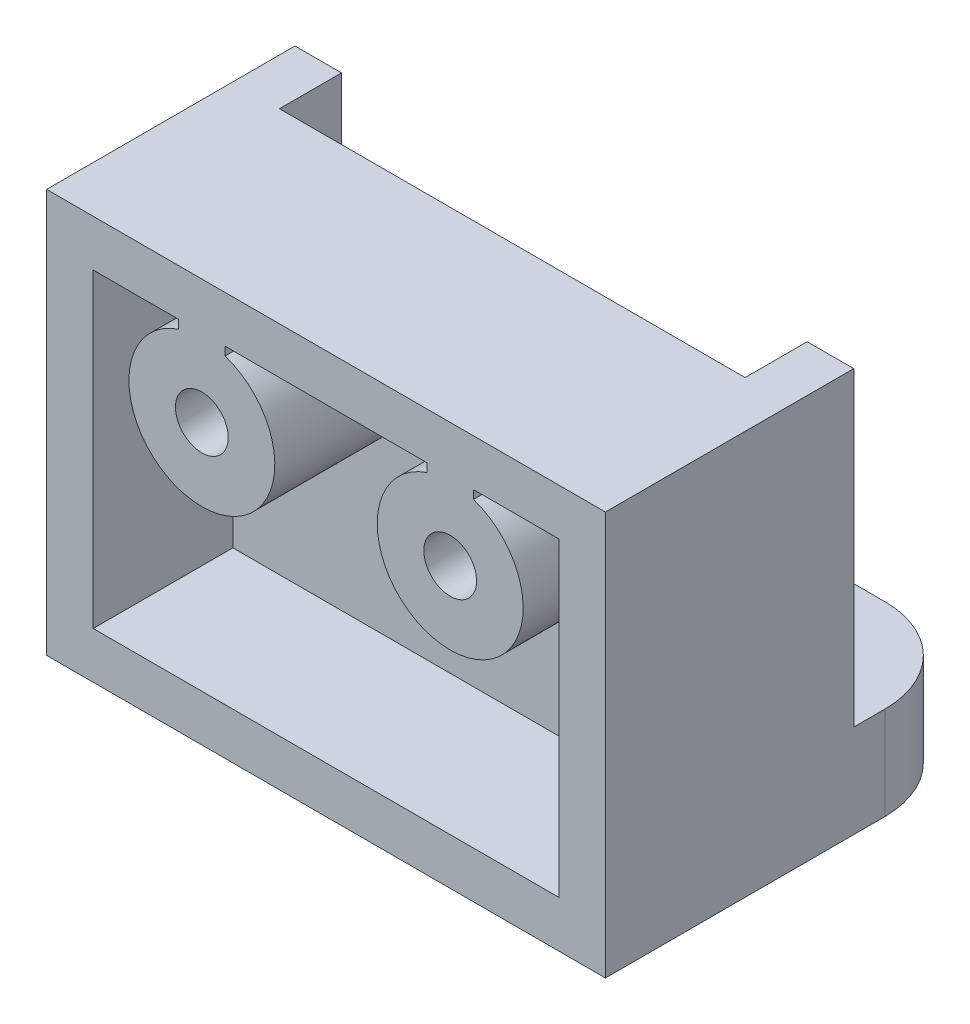
ISO-10303-21;
HEADER;
FILE_DESCRIPTION(('STEP AP214'),'2;1');
FILE_NAME('part.step','',(''),(''),'','','');
FILE_SCHEMA(('AUTOMOTIVE_DESIGN { 1 0 10303 214 1 1 1 1 }'));
ENDSEC;
DATA;
#1=APPLICATION_CONTEXT('core data for automotive mechanical design processes');
#2=APPLICATION_PROTOCOL_DEFINITION('international standard','automotive_design',2000,#1);
#3=PRODUCT_CONTEXT('',#1,'mechanical');
#4=PRODUCT('Part','Part','',(#3));
#5=PRODUCT_RELATED_PRODUCT_CATEGORY('part','',(#4));
#6=PRODUCT_DEFINITION_FORMATION('','',#4);
#7=PRODUCT_DEFINITION_CONTEXT('part definition',#1,'design');
#8=PRODUCT_DEFINITION('design','',#6,#7);
#9=PRODUCT_DEFINITION_SHAPE('','',#8);
#10=(LENGTH_UNIT() NAMED_UNIT(*) SI_UNIT(.MILLI.,.METRE.));
#11=(NAMED_UNIT(*) PLANE_ANGLE_UNIT() SI_UNIT($,.RADIAN.));
#12=(NAMED_UNIT(*) SI_UNIT($,.STERADIAN.) SOLID_ANGLE_UNIT());
#13=UNCERTAINTY_MEASURE_WITH_UNIT(LENGTH_MEASURE(1.E-05),#10,'distance_accuracy_value','');
#14=(GEOMETRIC_REPRESENTATION_CONTEXT(3) GLOBAL_UNCERTAINTY_ASSIGNED_CONTEXT((#13)) GLOBAL_UNIT_ASSIGNED_CONTEXT((#10,
#11,#12)) REPRESENTATION_CONTEXT('',''));
#15=CARTESIAN_POINT('',(0.,0.,0.));
#16=DIRECTION('',(0.,0.,1.));
#17=DIRECTION('',(1.,0.,0.));
#18=AXIS2_PLACEMENT_3D('',#15,#16,#17);
#19=CARTESIAN_POINT('',(0.,8.5,0.));
#20=DIRECTION('',(0.,1.,0.));
#21=DIRECTION('',(0.,0.,1.));
#22=AXIS2_PLACEMENT_3D('',#19,#20,#21);
#23=PLANE('',#22);
#24=DIRECTION('',(0.,0.,1.));
#25=VECTOR('',#24,1.);
#26=CARTESIAN_POINT('',(-3.25,8.5,0.));
#27=LINE('',#26,#25);
#28=CARTESIAN_POINT('',(-3.25,8.5,-20.5));
#29=VERTEX_POINT('',#28);
#30=CARTESIAN_POINT('',(-3.25,8.5,-16.));
#31=VERTEX_POINT('',#30);
#32=EDGE_CURVE('E198',#29,#31,#27,.T.);
#33=ORIENTED_EDGE('',*,*,#32,.F.);
#34=DIRECTION('',(-1.,0.,0.));
#35=VECTOR('',#34,1.);
#36=CARTESIAN_POINT('',(-7.49999999999999,8.5,-20.5));
#37=LINE('',#36,#35);
#38=CARTESIAN_POINT('',(3.25,8.5,-20.5));
#39=VERTEX_POINT('',#38);
#40=EDGE_CURVE('E403',#39,#29,#37,.T.);
#41=ORIENTED_EDGE('',*,*,#40,.F.);
#42=DIRECTION('',(0.,0.,1.));
#43=VECTOR('',#42,1.);
#44=CARTESIAN_POINT('',(3.25,8.5,0.));
#45=LINE('',#44,#43);
#46=CARTESIAN_POINT('',(3.25,8.5,-16.));
#47=VERTEX_POINT('',#46);
#48=EDGE_CURVE('E218',#39,#47,#45,.T.);
#49=ORIENTED_EDGE('',*,*,#48,.T.);
#50=DIRECTION('',(1.,0.,0.));
#51=VECTOR('',#50,1.);
#52=CARTESIAN_POINT('',(9.00000000000001,8.5,-16.));
#53=LINE('',#52,#51);
#54=EDGE_CURVE('E213',#31,#47,#53,.T.);
#55=ORIENTED_EDGE('',*,*,#54,.F.);
#56=EDGE_LOOP('',(#33,#41,#49,#55));
#57=FACE_BOUND('',#56,.T.);
#58=ADVANCED_FACE('F37',(#57),#23,.F.);
#59=DIRECTION('',(0.,0.,1.));
#60=VECTOR('',#59,1.);
#61=CARTESIAN_POINT('',(4.75,8.5,0.));
#62=LINE('',#61,#60);
#63=CARTESIAN_POINT('',(4.75,8.5,-20.5));
#64=VERTEX_POINT('',#63);
#65=CARTESIAN_POINT('',(4.75,8.5,-16.));
#66=VERTEX_POINT('',#65);
#67=EDGE_CURVE('E378',#64,#66,#62,.T.);
#68=ORIENTED_EDGE('',*,*,#67,.F.);
#69=CARTESIAN_POINT('',(7.5,8.5,-20.5));
#70=VERTEX_POINT('',#69);
#71=EDGE_CURVE('E377',#70,#64,#37,.T.);
#72=ORIENTED_EDGE('',*,*,#71,.F.);
#73=DIRECTION('',(0.,0.,-1.));
#74=VECTOR('',#73,1.);
#75=CARTESIAN_POINT('',(7.50000000000001,8.5,0.));
#76=LINE('',#75,#74);
#77=CARTESIAN_POINT('',(7.5,8.5,-16.));
#78=VERTEX_POINT('',#77);
#79=EDGE_CURVE('E390',#78,#70,#76,.T.);
#80=ORIENTED_EDGE('',*,*,#79,.F.);
#81=EDGE_CURVE('E220',#66,#78,#53,.T.);
#82=ORIENTED_EDGE('',*,*,#81,.F.);
#83=EDGE_LOOP('',(#68,#72,#80,#82));
#84=FACE_BOUND('',#83,.T.);
#85=ADVANCED_FACE('F432',(#84),#23,.F.);
#86=CARTESIAN_POINT('',(0.,0.,0.));
#87=DIRECTION('',(0.,-1.,0.));
#88=DIRECTION('',(0.,0.,-1.));
#89=AXIS2_PLACEMENT_3D('',#86,#87,#88);
#90=PLANE('',#89);
#91=CARTESIAN_POINT('',(-4.,0.,-25.));
#92=DIRECTION('',(0.,-1.,0.));
#93=DIRECTION('',(0.,0.,-1.));
#94=AXIS2_PLACEMENT_3D('',#91,#92,#93);
#95=CIRCLE('',#94,1.6);
#96=CARTESIAN_POINT('',(-4.,0.,-26.6));
#97=VERTEX_POINT('',#96);
#98=EDGE_CURVE('E308',#97,#97,#95,.T.);
#99=ORIENTED_EDGE('',*,*,#98,.T.);
#100=EDGE_LOOP('',(#99));
#101=FACE_BOUND('',#100,.T.);
#102=CARTESIAN_POINT('',(4.,0.,-25.));
#103=DIRECTION('',(0.,-1.,0.));
#104=DIRECTION('',(0.,0.,-1.));
#105=AXIS2_PLACEMENT_3D('',#102,#103,#104);
#106=CIRCLE('',#105,1.6);
#107=CARTESIAN_POINT('',(4.,0.,-26.6));
#108=VERTEX_POINT('',#107);
#109=EDGE_CURVE('E312',#108,#108,#106,.T.);
#110=ORIENTED_EDGE('',*,*,#109,.T.);
#111=EDGE_LOOP('',(#110));
#112=FACE_BOUND('',#111,.T.);
#113=CARTESIAN_POINT('',(6.,0.,-25.));
#114=DIRECTION('',(0.,-1.,0.));
#115=DIRECTION('',(0.,0.,-1.));
#116=AXIS2_PLACEMENT_3D('',#113,#114,#115);
#117=CIRCLE('',#116,3.);
#118=CARTESIAN_POINT('',(9.00000000000001,0.,-25.));
#119=VERTEX_POINT('',#118);
#120=CARTESIAN_POINT('',(6.,0.,-28.));
#121=VERTEX_POINT('',#120);
#122=EDGE_CURVE('E340',#119,#121,#117,.F.);
#123=ORIENTED_EDGE('',*,*,#122,.T.);
#124=DIRECTION('',(1.,0.,0.));
#125=VECTOR('',#124,1.);
#126=CARTESIAN_POINT('',(-8.99999999999999,0.,-28.));
#127=LINE('',#126,#125);
#128=CARTESIAN_POINT('',(-6.,0.,-28.));
#129=VERTEX_POINT('',#128);
#130=EDGE_CURVE('E325',#129,#121,#127,.T.);
#131=ORIENTED_EDGE('',*,*,#130,.F.);
#132=CARTESIAN_POINT('',(-6.,0.,-25.));
#133=DIRECTION('',(0.,-1.,0.));
#134=DIRECTION('',(0.,0.,-1.));
#135=AXIS2_PLACEMENT_3D('',#132,#133,#134);
#136=CIRCLE('',#135,3.);
#137=CARTESIAN_POINT('',(-8.99999999999999,0.,-25.));
#138=VERTEX_POINT('',#137);
#139=EDGE_CURVE('E337',#129,#138,#136,.F.);
#140=ORIENTED_EDGE('',*,*,#139,.T.);
#141=DIRECTION('',(0.,0.,-1.));
#142=VECTOR('',#141,1.);
#143=CARTESIAN_POINT('',(-8.99999999999999,0.,0.));
#144=LINE('',#143,#142);
#145=CARTESIAN_POINT('',(-8.99999999999999,0.,-24.));
#146=VERTEX_POINT('',#145);
#147=EDGE_CURVE('E332',#146,#138,#144,.T.);
#148=ORIENTED_EDGE('',*,*,#147,.F.);
#149=DIRECTION('',(-1.,0.,0.));
#150=VECTOR('',#149,1.);
#151=CARTESIAN_POINT('',(-8.99999999999999,0.,-24.));
#152=LINE('',#151,#150);
#153=CARTESIAN_POINT('',(-7.49999999999999,0.,-24.));
#154=VERTEX_POINT('',#153);
#155=EDGE_CURVE('E259',#154,#146,#152,.T.);
#156=ORIENTED_EDGE('',*,*,#155,.F.);
#157=DIRECTION('',(0.,0.,-1.));
#158=VECTOR('',#157,1.);
#159=CARTESIAN_POINT('',(-7.49999999999999,0.,-24.));
#160=LINE('',#159,#158);
#161=CARTESIAN_POINT('',(-7.49999999999999,0.,-22.));
#162=VERTEX_POINT('',#161);
#163=EDGE_CURVE('E281',#162,#154,#160,.T.);
#164=ORIENTED_EDGE('',*,*,#163,.F.);
#165=DIRECTION('',(-1.,0.,0.));
#166=VECTOR('',#165,1.);
#167=CARTESIAN_POINT('',(-7.49999999999999,0.,-22.));
#168=LINE('',#167,#166);
#169=CARTESIAN_POINT('',(7.50000000000001,0.,-22.));
#170=VERTEX_POINT('',#169);
#171=EDGE_CURVE('E279',#170,#162,#168,.T.);
#172=ORIENTED_EDGE('',*,*,#171,.F.);
#173=DIRECTION('',(0.,0.,1.));
#174=VECTOR('',#173,1.);
#175=CARTESIAN_POINT('',(7.50000000000001,0.,-24.));
#176=LINE('',#175,#174);
#177=CARTESIAN_POINT('',(7.50000000000001,0.,-24.));
#178=VERTEX_POINT('',#177);
#179=EDGE_CURVE('E276',#178,#170,#176,.T.);
#180=ORIENTED_EDGE('',*,*,#179,.F.);
#181=DIRECTION('',(-1.,0.,0.));
#182=VECTOR('',#181,1.);
#183=CARTESIAN_POINT('',(9.00000000000001,0.,-24.));
#184=LINE('',#183,#182);
#185=CARTESIAN_POINT('',(9.00000000000001,0.,-24.));
#186=VERTEX_POINT('',#185);
#187=EDGE_CURVE('E254',#186,#178,#184,.T.);
#188=ORIENTED_EDGE('',*,*,#187,.F.);
#189=DIRECTION('',(0.,0.,1.));
#190=VECTOR('',#189,1.);
#191=CARTESIAN_POINT('',(9.00000000000001,0.,-28.));
#192=LINE('',#191,#190);
#193=EDGE_CURVE('E318',#119,#186,#192,.T.);
#194=ORIENTED_EDGE('',*,*,#193,.F.);
#195=EDGE_LOOP('',(#123,#131,#140,#148,#156,#164,#172,#180,#188,#194));
#196=FACE_BOUND('',#195,.T.);
#197=ADVANCED_FACE('F454',(#101,#112,#196),#90,.F.);
#198=CARTESIAN_POINT('',(-8.99999999999999,30.,-10.1));
#199=DIRECTION('',(1.,0.,0.));
#200=DIRECTION('',(0.,0.,-1.));
#201=AXIS2_PLACEMENT_3D('',#198,#199,#200);
#202=PLANE('',#201);
#203=DIRECTION('',(0.,0.,-1.));
#204=VECTOR('',#203,1.);
#205=CARTESIAN_POINT('',(-8.99999999999999,-3.,0.));
#206=LINE('',#205,#204);
#207=CARTESIAN_POINT('',(-8.99999999999999,-3.,-16.));
#208=VERTEX_POINT('',#207);
#209=CARTESIAN_POINT('',(-8.99999999999999,-3.,-25.));
#210=VERTEX_POINT('',#209);
#211=EDGE_CURVE('E324',#208,#210,#206,.T.);
#212=ORIENTED_EDGE('',*,*,#211,.F.);
#213=DIRECTION('',(0.,-1.,0.));
#214=VECTOR('',#213,1.);
#215=CARTESIAN_POINT('',(-8.99999999999999,10.,-16.));
#216=LINE('',#215,#214);
#217=CARTESIAN_POINT('',(-8.99999999999999,10.,-16.));
#218=VERTEX_POINT('',#217);
#219=EDGE_CURVE('E287',#218,#208,#216,.T.);
#220=ORIENTED_EDGE('',*,*,#219,.F.);
#221=DIRECTION('',(0.,0.,1.));
#222=VECTOR('',#221,1.);
#223=CARTESIAN_POINT('',(-8.99999999999999,10.,-16.));
#224=LINE('',#223,#222);
#225=CARTESIAN_POINT('',(-8.99999999999999,10.,-24.));
#226=VERTEX_POINT('',#225);
#227=EDGE_CURVE('E269',#226,#218,#224,.T.);
#228=ORIENTED_EDGE('',*,*,#227,.F.);
#229=DIRECTION('',(0.,-1.,0.));
#230=VECTOR('',#229,1.);
#231=CARTESIAN_POINT('',(-8.99999999999999,10.,-24.));
#232=LINE('',#231,#230);
#233=EDGE_CURVE('E290',#226,#146,#232,.T.);
#234=ORIENTED_EDGE('',*,*,#233,.T.);
#235=ORIENTED_EDGE('',*,*,#147,.T.);
#236=DIRECTION('',(0.,1.,0.));
#237=VECTOR('',#236,1.);
#238=CARTESIAN_POINT('',(-9.,30.,-25.));
#239=LINE('',#238,#237);
#240=EDGE_CURVE('E353',#138,#210,#239,.F.);
#241=ORIENTED_EDGE('',*,*,#240,.T.);
#242=EDGE_LOOP('',(#212,#220,#228,#234,#235,#241));
#243=FACE_BOUND('',#242,.T.);
#244=ADVANCED_FACE('F530',(#243),#202,.F.);
#245=CARTESIAN_POINT('',(9.00000000000001,30.,0.));
#246=DIRECTION('',(-1.,0.,0.));
#247=DIRECTION('',(0.,0.,1.));
#248=AXIS2_PLACEMENT_3D('',#245,#246,#247);
#249=PLANE('',#248);
#250=DIRECTION('',(0.,-1.,0.));
#251=VECTOR('',#250,1.);
#252=CARTESIAN_POINT('',(9.00000000000001,10.,-16.));
#253=LINE('',#252,#251);
#254=CARTESIAN_POINT('',(9.00000000000001,10.,-16.));
#255=VERTEX_POINT('',#254);
#256=CARTESIAN_POINT('',(9.00000000000001,-3.,-16.));
#257=VERTEX_POINT('',#256);
#258=EDGE_CURVE('E273',#255,#257,#253,.T.);
#259=ORIENTED_EDGE('',*,*,#258,.T.);
#260=DIRECTION('',(0.,0.,1.));
#261=VECTOR('',#260,1.);
#262=CARTESIAN_POINT('',(9.00000000000001,-3.,-28.));
#263=LINE('',#262,#261);
#264=CARTESIAN_POINT('',(9.00000000000001,-3.,-25.));
#265=VERTEX_POINT('',#264);
#266=EDGE_CURVE('E321',#265,#257,#263,.T.);
#267=ORIENTED_EDGE('',*,*,#266,.F.);
#268=DIRECTION('',(0.,1.,0.));
#269=VECTOR('',#268,1.);
#270=CARTESIAN_POINT('',(9.,30.,-25.));
#271=LINE('',#270,#269);
#272=EDGE_CURVE('E329',#265,#119,#271,.T.);
#273=ORIENTED_EDGE('',*,*,#272,.T.);
#274=ORIENTED_EDGE('',*,*,#193,.T.);
#275=DIRECTION('',(0.,-1.,0.));
#276=VECTOR('',#275,1.);
#277=CARTESIAN_POINT('',(9.00000000000001,10.,-24.));
#278=LINE('',#277,#276);
#279=CARTESIAN_POINT('',(9.00000000000001,10.,-24.));
#280=VERTEX_POINT('',#279);
#281=EDGE_CURVE('E305',#280,#186,#278,.T.);
#282=ORIENTED_EDGE('',*,*,#281,.F.);
#283=DIRECTION('',(0.,0.,-1.));
#284=VECTOR('',#283,1.);
#285=CARTESIAN_POINT('',(9.00000000000001,10.,-16.));
#286=LINE('',#285,#284);
#287=EDGE_CURVE('E255',#255,#280,#286,.T.);
#288=ORIENTED_EDGE('',*,*,#287,.F.);
#289=EDGE_LOOP('',(#259,#267,#273,#274,#282,#288));
#290=FACE_BOUND('',#289,.T.);
#291=ADVANCED_FACE('F526',(#290),#249,.F.);
#292=CARTESIAN_POINT('',(0.,-3.,0.));
#293=DIRECTION('',(0.,-1.,0.));
#294=DIRECTION('',(0.,0.,-1.));
#295=AXIS2_PLACEMENT_3D('',#292,#293,#294);
#296=PLANE('',#295);
#297=CARTESIAN_POINT('',(-4.,-3.,-25.));
#298=DIRECTION('',(0.,-1.,0.));
#299=DIRECTION('',(0.,0.,-1.));
#300=AXIS2_PLACEMENT_3D('',#297,#298,#299);
#301=CIRCLE('',#300,1.6);
#302=CARTESIAN_POINT('',(-4.,-3.,-26.6));
#303=VERTEX_POINT('',#302);
#304=EDGE_CURVE('E309',#303,#303,#301,.T.);
#305=ORIENTED_EDGE('',*,*,#304,.F.);
#306=EDGE_LOOP('',(#305));
#307=FACE_BOUND('',#306,.T.);
#308=DIRECTION('',(1.,0.,0.));
#309=VECTOR('',#308,1.);
#310=CARTESIAN_POINT('',(-8.99999999999999,-3.,-28.));
#311=LINE('',#310,#309);
#312=CARTESIAN_POINT('',(-6.,-3.,-28.));
#313=VERTEX_POINT('',#312);
#314=CARTESIAN_POINT('',(6.,-3.,-28.));
#315=VERTEX_POINT('',#314);
#316=EDGE_CURVE('E327',#313,#315,#311,.T.);
#317=ORIENTED_EDGE('',*,*,#316,.T.);
#318=CARTESIAN_POINT('',(6.,-3.,-25.));
#319=DIRECTION('',(0.,-1.,0.));
#320=DIRECTION('',(0.,0.,-1.));
#321=AXIS2_PLACEMENT_3D('',#318,#319,#320);
#322=CIRCLE('',#321,3.);
#323=EDGE_CURVE('E351',#315,#265,#322,.T.);
#324=ORIENTED_EDGE('',*,*,#323,.T.);
#325=ORIENTED_EDGE('',*,*,#266,.T.);
#326=DIRECTION('',(-1.,0.,0.));
#327=VECTOR('',#326,1.);
#328=CARTESIAN_POINT('',(9.00000000000001,-3.,-16.));
#329=LINE('',#328,#327);
#330=EDGE_CURVE('E252',#257,#208,#329,.T.);
#331=ORIENTED_EDGE('',*,*,#330,.T.);
#332=ORIENTED_EDGE('',*,*,#211,.T.);
#333=CARTESIAN_POINT('',(-6.,-3.,-25.));
#334=DIRECTION('',(0.,-1.,0.));
#335=DIRECTION('',(0.,0.,-1.));
#336=AXIS2_PLACEMENT_3D('',#333,#334,#335);
#337=CIRCLE('',#336,3.);
#338=EDGE_CURVE('E349',#210,#313,#337,.T.);
#339=ORIENTED_EDGE('',*,*,#338,.T.);
#340=EDGE_LOOP('',(#317,#324,#325,#331,#332,#339));
#341=FACE_BOUND('',#340,.T.);
#342=CARTESIAN_POINT('',(4.,-3.,-25.));
#343=DIRECTION('',(0.,-1.,0.));
#344=DIRECTION('',(0.,0.,-1.));
#345=AXIS2_PLACEMENT_3D('',#342,#343,#344);
#346=CIRCLE('',#345,1.6);
#347=CARTESIAN_POINT('',(4.,-3.,-26.6));
#348=VERTEX_POINT('',#347);
#349=EDGE_CURVE('E315',#348,#348,#346,.T.);
#350=ORIENTED_EDGE('',*,*,#349,.F.);
#351=EDGE_LOOP('',(#350));
#352=FACE_BOUND('',#351,.T.);
#353=ADVANCED_FACE('F523',(#307,#341,#352),#296,.T.);
#354=CARTESIAN_POINT('',(-8.99999999999999,-3.,-28.));
#355=DIRECTION('',(0.,0.,1.));
#356=DIRECTION('',(1.,0.,0.));
#357=AXIS2_PLACEMENT_3D('',#354,#355,#356);
#358=PLANE('',#357);
#359=DIRECTION('',(0.,1.,0.));
#360=VECTOR('',#359,1.);
#361=CARTESIAN_POINT('',(6.,-3.,-28.));
#362=LINE('',#361,#360);
#363=EDGE_CURVE('E346',#121,#315,#362,.F.);
#364=ORIENTED_EDGE('',*,*,#363,.T.);
#365=ORIENTED_EDGE('',*,*,#316,.F.);
#366=DIRECTION('',(0.,1.,0.));
#367=VECTOR('',#366,1.);
#368=CARTESIAN_POINT('',(-6.,-3.,-28.));
#369=LINE('',#368,#367);
#370=EDGE_CURVE('E343',#313,#129,#369,.T.);
#371=ORIENTED_EDGE('',*,*,#370,.T.);
#372=ORIENTED_EDGE('',*,*,#130,.T.);
#373=EDGE_LOOP('',(#364,#365,#371,#372));
#374=FACE_BOUND('',#373,.T.);
#375=ADVANCED_FACE('F521',(#374),#358,.F.);
#376=CARTESIAN_POINT('',(4.,-3.,-25.));
#377=DIRECTION('',(0.,1.,0.));
#378=DIRECTION('',(0.,0.,1.));
#379=AXIS2_PLACEMENT_3D('',#376,#377,#378);
#380=CYLINDRICAL_SURFACE('',#379,1.6);
#381=ORIENTED_EDGE('',*,*,#109,.F.);
#382=EDGE_LOOP('',(#381));
#383=FACE_BOUND('',#382,.T.);
#384=ORIENTED_EDGE('',*,*,#349,.T.);
#385=EDGE_LOOP('',(#384));
#386=FACE_BOUND('',#385,.T.);
#387=ADVANCED_FACE('F517',(#383,#386),#380,.F.);
#388=CARTESIAN_POINT('',(-4.,-3.,-25.));
#389=DIRECTION('',(0.,1.,0.));
#390=DIRECTION('',(0.,0.,1.));
#391=AXIS2_PLACEMENT_3D('',#388,#389,#390);
#392=CYLINDRICAL_SURFACE('',#391,1.6);
#393=ORIENTED_EDGE('',*,*,#98,.F.);
#394=EDGE_LOOP('',(#393));
#395=FACE_BOUND('',#394,.T.);
#396=ORIENTED_EDGE('',*,*,#304,.T.);
#397=EDGE_LOOP('',(#396));
#398=FACE_BOUND('',#397,.T.);
#399=ADVANCED_FACE('F513',(#395,#398),#392,.F.);
#400=CARTESIAN_POINT('',(6.,30.,-25.));
#401=DIRECTION('',(0.,1.,0.));
#402=DIRECTION('',(0.,0.,1.));
#403=AXIS2_PLACEMENT_3D('',#400,#401,#402);
#404=CYLINDRICAL_SURFACE('',#403,3.);
#405=ORIENTED_EDGE('',*,*,#323,.F.);
#406=ORIENTED_EDGE('',*,*,#363,.F.);
#407=ORIENTED_EDGE('',*,*,#122,.F.);
#408=ORIENTED_EDGE('',*,*,#272,.F.);
#409=EDGE_LOOP('',(#405,#406,#407,#408));
#410=FACE_BOUND('',#409,.T.);
#411=ADVANCED_FACE('F516',(#410),#404,.T.);
#412=CARTESIAN_POINT('',(-6.,-3.,-25.));
#413=DIRECTION('',(0.,1.,0.));
#414=DIRECTION('',(0.,0.,1.));
#415=AXIS2_PLACEMENT_3D('',#412,#413,#414);
#416=CYLINDRICAL_SURFACE('',#415,3.);
#417=ORIENTED_EDGE('',*,*,#338,.F.);
#418=ORIENTED_EDGE('',*,*,#240,.F.);
#419=ORIENTED_EDGE('',*,*,#139,.F.);
#420=ORIENTED_EDGE('',*,*,#370,.F.);
#421=EDGE_LOOP('',(#417,#418,#419,#420));
#422=FACE_BOUND('',#421,.T.);
#423=ADVANCED_FACE('F39',(#422),#416,.T.);
#424=CARTESIAN_POINT('',(9.00000000000001,10.,-24.));
#425=DIRECTION('',(0.,0.,1.));
#426=DIRECTION('',(1.,0.,0.));
#427=AXIS2_PLACEMENT_3D('',#424,#425,#426);
#428=PLANE('',#427);
#429=ORIENTED_EDGE('',*,*,#187,.T.);
#430=DIRECTION('',(0.,-1.,0.));
#431=VECTOR('',#430,1.);
#432=CARTESIAN_POINT('',(7.50000000000001,10.,-24.));
#433=LINE('',#432,#431);
#434=CARTESIAN_POINT('',(7.50000000000001,10.,-24.));
#435=VERTEX_POINT('',#434);
#436=EDGE_CURVE('E302',#435,#178,#433,.T.);
#437=ORIENTED_EDGE('',*,*,#436,.F.);
#438=DIRECTION('',(-1.,0.,0.));
#439=VECTOR('',#438,1.);
#440=CARTESIAN_POINT('',(9.00000000000001,10.,-24.));
#441=LINE('',#440,#439);
#442=EDGE_CURVE('E258',#280,#435,#441,.T.);
#443=ORIENTED_EDGE('',*,*,#442,.F.);
#444=ORIENTED_EDGE('',*,*,#281,.T.);
#445=EDGE_LOOP('',(#429,#437,#443,#444));
#446=FACE_BOUND('',#445,.T.);
#447=ADVANCED_FACE('F508',(#446),#428,.F.);
#448=CARTESIAN_POINT('',(7.50000000000001,10.,-24.));
#449=DIRECTION('',(1.,0.,0.));
#450=DIRECTION('',(0.,0.,-1.));
#451=AXIS2_PLACEMENT_3D('',#448,#449,#450);
#452=PLANE('',#451);
#453=ORIENTED_EDGE('',*,*,#179,.T.);
#454=DIRECTION('',(0.,-1.,0.));
#455=VECTOR('',#454,1.);
#456=CARTESIAN_POINT('',(7.50000000000001,10.,-22.));
#457=LINE('',#456,#455);
#458=CARTESIAN_POINT('',(7.50000000000001,10.,-22.));
#459=VERTEX_POINT('',#458);
#460=EDGE_CURVE('E299',#459,#170,#457,.T.);
#461=ORIENTED_EDGE('',*,*,#460,.F.);
#462=DIRECTION('',(0.,0.,1.));
#463=VECTOR('',#462,1.);
#464=CARTESIAN_POINT('',(7.50000000000001,10.,-24.));
#465=LINE('',#464,#463);
#466=EDGE_CURVE('E261',#435,#459,#465,.T.);
#467=ORIENTED_EDGE('',*,*,#466,.F.);
#468=ORIENTED_EDGE('',*,*,#436,.T.);
#469=EDGE_LOOP('',(#453,#461,#467,#468));
#470=FACE_BOUND('',#469,.T.);
#471=ADVANCED_FACE('F504',(#470),#452,.F.);
#472=CARTESIAN_POINT('',(-7.49999999999999,10.,-22.));
#473=DIRECTION('',(0.,0.,1.));
#474=DIRECTION('',(1.,0.,0.));
#475=AXIS2_PLACEMENT_3D('',#472,#473,#474);
#476=PLANE('',#475);
#477=CARTESIAN_POINT('',(-4.,6.,-22.));
#478=DIRECTION('',(0.,0.,-1.));
#479=DIRECTION('',(-1.,0.,0.));
#480=AXIS2_PLACEMENT_3D('',#477,#478,#479);
#481=CIRCLE('',#480,0.85);
#482=CARTESIAN_POINT('',(-4.85,6.,-22.));
#483=VERTEX_POINT('',#482);
#484=EDGE_CURVE('E246',#483,#483,#481,.T.);
#485=ORIENTED_EDGE('',*,*,#484,.F.);
#486=EDGE_LOOP('',(#485));
#487=FACE_BOUND('',#486,.T.);
#488=CARTESIAN_POINT('',(4.,6.,-22.));
#489=DIRECTION('',(0.,0.,-1.));
#490=DIRECTION('',(-1.,0.,0.));
#491=AXIS2_PLACEMENT_3D('',#488,#489,#490);
#492=CIRCLE('',#491,0.85);
#493=CARTESIAN_POINT('',(3.15,6.,-22.));
#494=VERTEX_POINT('',#493);
#495=EDGE_CURVE('E240',#494,#494,#492,.T.);
#496=ORIENTED_EDGE('',*,*,#495,.F.);
#497=EDGE_LOOP('',(#496));
#498=FACE_BOUND('',#497,.T.);
#499=ORIENTED_EDGE('',*,*,#171,.T.);
#500=DIRECTION('',(0.,-1.,0.));
#501=VECTOR('',#500,1.);
#502=CARTESIAN_POINT('',(-7.49999999999999,10.,-22.));
#503=LINE('',#502,#501);
#504=CARTESIAN_POINT('',(-7.49999999999999,10.,-22.));
#505=VERTEX_POINT('',#504);
#506=EDGE_CURVE('E296',#505,#162,#503,.T.);
#507=ORIENTED_EDGE('',*,*,#506,.F.);
#508=DIRECTION('',(-1.,0.,0.));
#509=VECTOR('',#508,1.);
#510=CARTESIAN_POINT('',(-7.49999999999999,10.,-22.));
#511=LINE('',#510,#509);
#512=EDGE_CURVE('E263',#459,#505,#511,.T.);
#513=ORIENTED_EDGE('',*,*,#512,.F.);
#514=ORIENTED_EDGE('',*,*,#460,.T.);
#515=EDGE_LOOP('',(#499,#507,#513,#514));
#516=FACE_BOUND('',#515,.T.);
#517=ADVANCED_FACE('F500',(#487,#498,#516),#476,.F.);
#518=CARTESIAN_POINT('',(-7.49999999999999,10.,-24.));
#519=DIRECTION('',(-1.,0.,0.));
#520=DIRECTION('',(0.,0.,1.));
#521=AXIS2_PLACEMENT_3D('',#518,#519,#520);
#522=PLANE('',#521);
#523=ORIENTED_EDGE('',*,*,#163,.T.);
#524=DIRECTION('',(0.,-1.,0.));
#525=VECTOR('',#524,1.);
#526=CARTESIAN_POINT('',(-7.49999999999999,10.,-24.));
#527=LINE('',#526,#525);
#528=CARTESIAN_POINT('',(-7.49999999999999,10.,-24.));
#529=VERTEX_POINT('',#528);
#530=EDGE_CURVE('E293',#529,#154,#527,.T.);
#531=ORIENTED_EDGE('',*,*,#530,.F.);
#532=DIRECTION('',(0.,0.,-1.));
#533=VECTOR('',#532,1.);
#534=CARTESIAN_POINT('',(-7.49999999999999,10.,-24.));
#535=LINE('',#534,#533);
#536=EDGE_CURVE('E265',#505,#529,#535,.T.);
#537=ORIENTED_EDGE('',*,*,#536,.F.);
#538=ORIENTED_EDGE('',*,*,#506,.T.);
#539=EDGE_LOOP('',(#523,#531,#537,#538));
#540=FACE_BOUND('',#539,.T.);
#541=ADVANCED_FACE('F496',(#540),#522,.F.);
#542=CARTESIAN_POINT('',(-8.99999999999999,10.,-24.));
#543=DIRECTION('',(0.,0.,1.));
#544=DIRECTION('',(1.,0.,0.));
#545=AXIS2_PLACEMENT_3D('',#542,#543,#544);
#546=PLANE('',#545);
#547=ORIENTED_EDGE('',*,*,#155,.T.);
#548=ORIENTED_EDGE('',*,*,#233,.F.);
#549=DIRECTION('',(-1.,0.,0.));
#550=VECTOR('',#549,1.);
#551=CARTESIAN_POINT('',(-8.99999999999999,10.,-24.));
#552=LINE('',#551,#550);
#553=EDGE_CURVE('E267',#529,#226,#552,.T.);
#554=ORIENTED_EDGE('',*,*,#553,.F.);
#555=ORIENTED_EDGE('',*,*,#530,.T.);
#556=EDGE_LOOP('',(#547,#548,#554,#555));
#557=FACE_BOUND('',#556,.T.);
#558=ADVANCED_FACE('F493',(#557),#546,.F.);
#559=CARTESIAN_POINT('',(9.00000000000001,10.,-16.));
#560=DIRECTION('',(0.,0.,-1.));
#561=DIRECTION('',(-1.,0.,0.));
#562=AXIS2_PLACEMENT_3D('',#559,#560,#561);
#563=PLANE('',#562);
#564=DIRECTION('',(0.,1.,0.));
#565=VECTOR('',#564,1.);
#566=CARTESIAN_POINT('',(-4.75,6.,-16.));
#567=LINE('',#566,#565);
#568=CARTESIAN_POINT('',(-4.75,8.22710574513201,-16.));
#569=VERTEX_POINT('',#568);
#570=CARTESIAN_POINT('',(-4.75,8.5,-16.));
#571=VERTEX_POINT('',#570);
#572=EDGE_CURVE('E215',#569,#571,#567,.T.);
#573=ORIENTED_EDGE('',*,*,#572,.F.);
#574=CARTESIAN_POINT('',(-4.,6.,-16.));
#575=DIRECTION('',(0.,0.,-1.));
#576=DIRECTION('',(-1.,0.,0.));
#577=AXIS2_PLACEMENT_3D('',#574,#575,#576);
#578=CIRCLE('',#577,2.35);
#579=CARTESIAN_POINT('',(-3.25,8.22710574513201,-16.));
#580=VERTEX_POINT('',#579);
#581=EDGE_CURVE('E52',#569,#580,#578,.F.);
#582=ORIENTED_EDGE('',*,*,#581,.T.);
#583=DIRECTION('',(0.,1.,0.));
#584=VECTOR('',#583,1.);
#585=CARTESIAN_POINT('',(-3.25,6.,-16.));
#586=LINE('',#585,#584);
#587=EDGE_CURVE('E201',#580,#31,#586,.T.);
#588=ORIENTED_EDGE('',*,*,#587,.T.);
#589=ORIENTED_EDGE('',*,*,#54,.T.);
#590=DIRECTION('',(0.,1.,0.));
#591=VECTOR('',#590,1.);
#592=CARTESIAN_POINT('',(3.25,6.,-16.));
#593=LINE('',#592,#591);
#594=CARTESIAN_POINT('',(3.25,8.22710574513201,-16.));
#595=VERTEX_POINT('',#594);
#596=EDGE_CURVE('E379',#595,#47,#593,.T.);
#597=ORIENTED_EDGE('',*,*,#596,.F.);
#598=CARTESIAN_POINT('',(4.,6.,-16.));
#599=DIRECTION('',(0.,0.,-1.));
#600=DIRECTION('',(-1.,0.,0.));
#601=AXIS2_PLACEMENT_3D('',#598,#599,#600);
#602=CIRCLE('',#601,2.35);
#603=CARTESIAN_POINT('',(4.75,8.22710574513201,-16.));
#604=VERTEX_POINT('',#603);
#605=EDGE_CURVE('E59',#595,#604,#602,.F.);
#606=ORIENTED_EDGE('',*,*,#605,.T.);
#607=DIRECTION('',(0.,1.,0.));
#608=VECTOR('',#607,1.);
#609=CARTESIAN_POINT('',(4.75,6.,-16.));
#610=LINE('',#609,#608);
#611=EDGE_CURVE('E370',#604,#66,#610,.T.);
#612=ORIENTED_EDGE('',*,*,#611,.T.);
#613=ORIENTED_EDGE('',*,*,#81,.T.);
#614=DIRECTION('',(0.,-1.,0.));
#615=VECTOR('',#614,1.);
#616=CARTESIAN_POINT('',(7.5,30.,-16.));
#617=LINE('',#616,#615);
#618=CARTESIAN_POINT('',(7.5,-1.5,-16.));
#619=VERTEX_POINT('',#618);
#620=EDGE_CURVE('E223',#78,#619,#617,.T.);
#621=ORIENTED_EDGE('',*,*,#620,.T.);
#622=DIRECTION('',(-1.,0.,0.));
#623=VECTOR('',#622,1.);
#624=CARTESIAN_POINT('',(9.00000000000001,-1.5,-16.));
#625=LINE('',#624,#623);
#626=CARTESIAN_POINT('',(-7.5,-1.5,-16.));
#627=VERTEX_POINT('',#626);
#628=EDGE_CURVE('E229',#619,#627,#625,.T.);
#629=ORIENTED_EDGE('',*,*,#628,.T.);
#630=DIRECTION('',(0.,-1.,0.));
#631=VECTOR('',#630,1.);
#632=CARTESIAN_POINT('',(-7.49999999999999,10.,-16.));
#633=LINE('',#632,#631);
#634=CARTESIAN_POINT('',(-7.5,8.5,-16.));
#635=VERTEX_POINT('',#634);
#636=EDGE_CURVE('E396',#635,#627,#633,.T.);
#637=ORIENTED_EDGE('',*,*,#636,.F.);
#638=EDGE_CURVE('E219',#635,#571,#53,.T.);
#639=ORIENTED_EDGE('',*,*,#638,.T.);
#640=EDGE_LOOP('',(#573,#582,#588,#589,#597,#606,#612,#613,#621,#629,#637,#639));
#641=FACE_BOUND('',#640,.T.);
#642=CARTESIAN_POINT('',(-4.,6.,-16.));
#643=DIRECTION('',(0.,0.,-1.));
#644=DIRECTION('',(-1.,0.,0.));
#645=AXIS2_PLACEMENT_3D('',#642,#643,#644);
#646=CIRCLE('',#645,0.85);
#647=CARTESIAN_POINT('',(-4.85,6.,-16.));
#648=VERTEX_POINT('',#647);
#649=EDGE_CURVE('E249',#648,#648,#646,.F.);
#650=ORIENTED_EDGE('',*,*,#649,.F.);
#651=EDGE_LOOP('',(#650));
#652=FACE_BOUND('',#651,.T.);
#653=ORIENTED_EDGE('',*,*,#219,.T.);
#654=ORIENTED_EDGE('',*,*,#330,.F.);
#655=ORIENTED_EDGE('',*,*,#258,.F.);
#656=DIRECTION('',(1.,0.,0.));
#657=VECTOR('',#656,1.);
#658=CARTESIAN_POINT('',(9.00000000000001,10.,-16.));
#659=LINE('',#658,#657);
#660=EDGE_CURVE('E271',#218,#255,#659,.T.);
#661=ORIENTED_EDGE('',*,*,#660,.F.);
#662=EDGE_LOOP('',(#653,#654,#655,#661));
#663=FACE_BOUND('',#662,.T.);
#664=CARTESIAN_POINT('',(4.,6.,-16.));
#665=DIRECTION('',(0.,0.,-1.));
#666=DIRECTION('',(-1.,0.,0.));
#667=AXIS2_PLACEMENT_3D('',#664,#665,#666);
#668=CIRCLE('',#667,0.85);
#669=CARTESIAN_POINT('',(3.15,6.,-16.));
#670=VERTEX_POINT('',#669);
#671=EDGE_CURVE('E243',#670,#670,#668,.F.);
#672=ORIENTED_EDGE('',*,*,#671,.F.);
#673=EDGE_LOOP('',(#672));
#674=FACE_BOUND('',#673,.T.);
#675=ADVANCED_FACE('F211',(#641,#652,#663,#674),#563,.F.);
#676=CARTESIAN_POINT('',(0.,10.,0.));
#677=DIRECTION('',(0.,1.,0.));
#678=DIRECTION('',(0.,0.,1.));
#679=AXIS2_PLACEMENT_3D('',#676,#677,#678);
#680=PLANE('',#679);
#681=ORIENTED_EDGE('',*,*,#660,.T.);
#682=ORIENTED_EDGE('',*,*,#287,.T.);
#683=ORIENTED_EDGE('',*,*,#442,.T.);
#684=ORIENTED_EDGE('',*,*,#466,.T.);
#685=ORIENTED_EDGE('',*,*,#512,.T.);
#686=ORIENTED_EDGE('',*,*,#536,.T.);
#687=ORIENTED_EDGE('',*,*,#553,.T.);
#688=ORIENTED_EDGE('',*,*,#227,.T.);
#689=EDGE_LOOP('',(#681,#682,#683,#684,#685,#686,#687,#688));
#690=FACE_BOUND('',#689,.T.);
#691=ADVANCED_FACE('F483',(#690),#680,.T.);
#692=CARTESIAN_POINT('',(-4.,6.,-15.999));
#693=DIRECTION('',(0.,0.,-1.));
#694=DIRECTION('',(-1.,0.,0.));
#695=AXIS2_PLACEMENT_3D('',#692,#693,#694);
#696=CYLINDRICAL_SURFACE('',#695,0.85);
#697=ORIENTED_EDGE('',*,*,#649,.T.);
#698=EDGE_LOOP('',(#697));
#699=FACE_BOUND('',#698,.T.);
#700=ORIENTED_EDGE('',*,*,#484,.T.);
#701=EDGE_LOOP('',(#700));
#702=FACE_BOUND('',#701,.T.);
#703=ADVANCED_FACE('F477',(#699,#702),#696,.F.);
#704=CARTESIAN_POINT('',(4.,6.,-15.999));
#705=DIRECTION('',(0.,0.,-1.));
#706=DIRECTION('',(-1.,0.,0.));
#707=AXIS2_PLACEMENT_3D('',#704,#705,#706);
#708=CYLINDRICAL_SURFACE('',#707,0.85);
#709=ORIENTED_EDGE('',*,*,#671,.T.);
#710=EDGE_LOOP('',(#709));
#711=FACE_BOUND('',#710,.T.);
#712=ORIENTED_EDGE('',*,*,#495,.T.);
#713=EDGE_LOOP('',(#712));
#714=FACE_BOUND('',#713,.T.);
#715=ADVANCED_FACE('F473',(#711,#714),#708,.F.);
#716=CARTESIAN_POINT('',(-7.49999999999999,30.,-10.1));
#717=DIRECTION('',(1.,0.,0.));
#718=DIRECTION('',(0.,0.,-1.));
#719=AXIS2_PLACEMENT_3D('',#716,#717,#718);
#720=PLANE('',#719);
#721=DIRECTION('',(0.,1.,0.));
#722=VECTOR('',#721,1.);
#723=CARTESIAN_POINT('',(-7.5,10.,-20.5));
#724=LINE('',#723,#722);
#725=CARTESIAN_POINT('',(-7.5,-1.5,-20.5));
#726=VERTEX_POINT('',#725);
#727=CARTESIAN_POINT('',(-7.5,8.5,-20.5));
#728=VERTEX_POINT('',#727);
#729=EDGE_CURVE('E236',#726,#728,#724,.T.);
#730=ORIENTED_EDGE('',*,*,#729,.T.);
#731=DIRECTION('',(0.,0.,1.));
#732=VECTOR('',#731,1.);
#733=CARTESIAN_POINT('',(-7.49999999999999,8.5,-10.1));
#734=LINE('',#733,#732);
#735=EDGE_CURVE('E224',#728,#635,#734,.T.);
#736=ORIENTED_EDGE('',*,*,#735,.T.);
#737=ORIENTED_EDGE('',*,*,#636,.T.);
#738=DIRECTION('',(0.,0.,-1.));
#739=VECTOR('',#738,1.);
#740=CARTESIAN_POINT('',(-7.49999999999999,-1.5,-10.1));
#741=LINE('',#740,#739);
#742=EDGE_CURVE('E237',#627,#726,#741,.T.);
#743=ORIENTED_EDGE('',*,*,#742,.T.);
#744=EDGE_LOOP('',(#730,#736,#737,#743));
#745=FACE_BOUND('',#744,.T.);
#746=ADVANCED_FACE('F415',(#745),#720,.T.);
#747=CARTESIAN_POINT('',(-7.49999999999999,10.,-20.5));
#748=DIRECTION('',(0.,0.,1.));
#749=DIRECTION('',(1.,0.,0.));
#750=AXIS2_PLACEMENT_3D('',#747,#748,#749);
#751=PLANE('',#750);
#752=DIRECTION('',(0.,-1.,0.));
#753=VECTOR('',#752,1.);
#754=CARTESIAN_POINT('',(-3.25,10.,-20.5));
#755=LINE('',#754,#753);
#756=CARTESIAN_POINT('',(-3.25,8.22710574513201,-20.5));
#757=VERTEX_POINT('',#756);
#758=EDGE_CURVE('E204',#29,#757,#755,.T.);
#759=ORIENTED_EDGE('',*,*,#758,.T.);
#760=CARTESIAN_POINT('',(-4.,6.,-20.5));
#761=DIRECTION('',(0.,0.,1.));
#762=DIRECTION('',(1.,0.,0.));
#763=AXIS2_PLACEMENT_3D('',#760,#761,#762);
#764=CIRCLE('',#763,2.35);
#765=CARTESIAN_POINT('',(-4.75,8.22710574513201,-20.5));
#766=VERTEX_POINT('',#765);
#767=EDGE_CURVE('E230',#757,#766,#764,.F.);
#768=ORIENTED_EDGE('',*,*,#767,.T.);
#769=DIRECTION('',(0.,-1.,0.));
#770=VECTOR('',#769,1.);
#771=CARTESIAN_POINT('',(-4.75,10.,-20.5));
#772=LINE('',#771,#770);
#773=CARTESIAN_POINT('',(-4.75,8.5,-20.5));
#774=VERTEX_POINT('',#773);
#775=EDGE_CURVE('E209',#774,#766,#772,.T.);
#776=ORIENTED_EDGE('',*,*,#775,.F.);
#777=EDGE_CURVE('E399',#774,#728,#37,.T.);
#778=ORIENTED_EDGE('',*,*,#777,.T.);
#779=ORIENTED_EDGE('',*,*,#729,.F.);
#780=DIRECTION('',(-1.,0.,0.));
#781=VECTOR('',#780,1.);
#782=CARTESIAN_POINT('',(0.,-1.5,-20.5));
#783=LINE('',#782,#781);
#784=CARTESIAN_POINT('',(7.5,-1.5,-20.5));
#785=VERTEX_POINT('',#784);
#786=EDGE_CURVE('E388',#785,#726,#783,.T.);
#787=ORIENTED_EDGE('',*,*,#786,.F.);
#788=DIRECTION('',(0.,-1.,0.));
#789=VECTOR('',#788,1.);
#790=CARTESIAN_POINT('',(7.5,10.,-20.5));
#791=LINE('',#790,#789);
#792=EDGE_CURVE('E233',#70,#785,#791,.T.);
#793=ORIENTED_EDGE('',*,*,#792,.F.);
#794=ORIENTED_EDGE('',*,*,#71,.T.);
#795=DIRECTION('',(0.,-1.,0.));
#796=VECTOR('',#795,1.);
#797=CARTESIAN_POINT('',(4.75,10.,-20.5));
#798=LINE('',#797,#796);
#799=CARTESIAN_POINT('',(4.75,8.22710574513201,-20.5));
#800=VERTEX_POINT('',#799);
#801=EDGE_CURVE('E368',#64,#800,#798,.T.);
#802=ORIENTED_EDGE('',*,*,#801,.T.);
#803=CARTESIAN_POINT('',(4.,6.,-20.5));
#804=DIRECTION('',(0.,0.,1.));
#805=DIRECTION('',(1.,0.,0.));
#806=AXIS2_PLACEMENT_3D('',#803,#804,#805);
#807=CIRCLE('',#806,2.35);
#808=CARTESIAN_POINT('',(3.25,8.22710574513201,-20.5));
#809=VERTEX_POINT('',#808);
#810=EDGE_CURVE('E232',#800,#809,#807,.F.);
#811=ORIENTED_EDGE('',*,*,#810,.T.);
#812=DIRECTION('',(0.,-1.,0.));
#813=VECTOR('',#812,1.);
#814=CARTESIAN_POINT('',(3.25,10.,-20.5));
#815=LINE('',#814,#813);
#816=EDGE_CURVE('E381',#39,#809,#815,.T.);
#817=ORIENTED_EDGE('',*,*,#816,.F.);
#818=ORIENTED_EDGE('',*,*,#40,.T.);
#819=EDGE_LOOP('',(#759,#768,#776,#778,#779,#787,#793,#794,#802,#811,#817,#818));
#820=FACE_BOUND('',#819,.T.);
#821=ADVANCED_FACE('F373',(#820),#751,.T.);
#822=CARTESIAN_POINT('',(7.50000000000001,30.,0.));
#823=DIRECTION('',(-1.,0.,0.));
#824=DIRECTION('',(0.,0.,1.));
#825=AXIS2_PLACEMENT_3D('',#822,#823,#824);
#826=PLANE('',#825);
#827=ORIENTED_EDGE('',*,*,#792,.T.);
#828=DIRECTION('',(0.,0.,1.));
#829=VECTOR('',#828,1.);
#830=CARTESIAN_POINT('',(7.50000000000001,-1.5,0.));
#831=LINE('',#830,#829);
#832=EDGE_CURVE('E393',#785,#619,#831,.T.);
#833=ORIENTED_EDGE('',*,*,#832,.T.);
#834=ORIENTED_EDGE('',*,*,#620,.F.);
#835=ORIENTED_EDGE('',*,*,#79,.T.);
#836=EDGE_LOOP('',(#827,#833,#834,#835));
#837=FACE_BOUND('',#836,.T.);
#838=ADVANCED_FACE('F434',(#837),#826,.T.);
#839=CARTESIAN_POINT('',(0.,-1.5,0.));
#840=DIRECTION('',(0.,-1.,0.));
#841=DIRECTION('',(0.,0.,-1.));
#842=AXIS2_PLACEMENT_3D('',#839,#840,#841);
#843=PLANE('',#842);
#844=ORIENTED_EDGE('',*,*,#786,.T.);
#845=ORIENTED_EDGE('',*,*,#742,.F.);
#846=ORIENTED_EDGE('',*,*,#628,.F.);
#847=ORIENTED_EDGE('',*,*,#832,.F.);
#848=EDGE_LOOP('',(#844,#845,#846,#847));
#849=FACE_BOUND('',#848,.T.);
#850=ADVANCED_FACE('F412',(#849),#843,.F.);
#851=ORIENTED_EDGE('',*,*,#777,.F.);
#852=DIRECTION('',(0.,0.,1.));
#853=VECTOR('',#852,1.);
#854=CARTESIAN_POINT('',(-4.75,8.5,0.));
#855=LINE('',#854,#853);
#856=EDGE_CURVE('E422',#774,#571,#855,.T.);
#857=ORIENTED_EDGE('',*,*,#856,.T.);
#858=ORIENTED_EDGE('',*,*,#638,.F.);
#859=ORIENTED_EDGE('',*,*,#735,.F.);
#860=EDGE_LOOP('',(#851,#857,#858,#859));
#861=FACE_BOUND('',#860,.T.);
#862=ADVANCED_FACE('F421',(#861),#23,.F.);
#863=CARTESIAN_POINT('',(-4.,6.,-15.999));
#864=DIRECTION('',(0.,0.,-1.));
#865=DIRECTION('',(-1.,0.,0.));
#866=AXIS2_PLACEMENT_3D('',#863,#864,#865);
#867=CYLINDRICAL_SURFACE('',#866,2.35);
#868=DIRECTION('',(0.,0.,-1.));
#869=VECTOR('',#868,1.);
#870=CARTESIAN_POINT('',(-3.25,8.22710574513201,-15.999));
#871=LINE('',#870,#869);
#872=EDGE_CURVE('E41',#757,#580,#871,.F.);
#873=ORIENTED_EDGE('',*,*,#872,.T.);
#874=ORIENTED_EDGE('',*,*,#581,.F.);
#875=DIRECTION('',(0.,0.,-1.));
#876=VECTOR('',#875,1.);
#877=CARTESIAN_POINT('',(-4.75,8.22710574513201,-15.999));
#878=LINE('',#877,#876);
#879=EDGE_CURVE('E11',#766,#569,#878,.F.);
#880=ORIENTED_EDGE('',*,*,#879,.F.);
#881=ORIENTED_EDGE('',*,*,#767,.F.);
#882=EDGE_LOOP('',(#873,#874,#880,#881));
#883=FACE_BOUND('',#882,.T.);
#884=ADVANCED_FACE('F446',(#883),#867,.T.);
#885=CARTESIAN_POINT('',(4.,6.,-15.999));
#886=DIRECTION('',(0.,0.,-1.));
#887=DIRECTION('',(-1.,0.,0.));
#888=AXIS2_PLACEMENT_3D('',#885,#886,#887);
#889=CYLINDRICAL_SURFACE('',#888,2.35);
#890=DIRECTION('',(0.,0.,-1.));
#891=VECTOR('',#890,1.);
#892=CARTESIAN_POINT('',(4.75,8.22710574513201,-15.999));
#893=LINE('',#892,#891);
#894=EDGE_CURVE('E356',#800,#604,#893,.F.);
#895=ORIENTED_EDGE('',*,*,#894,.T.);
#896=ORIENTED_EDGE('',*,*,#605,.F.);
#897=DIRECTION('',(0.,0.,-1.));
#898=VECTOR('',#897,1.);
#899=CARTESIAN_POINT('',(3.25,8.22710574513201,-15.999));
#900=LINE('',#899,#898);
#901=EDGE_CURVE('E357',#809,#595,#900,.F.);
#902=ORIENTED_EDGE('',*,*,#901,.F.);
#903=ORIENTED_EDGE('',*,*,#810,.F.);
#904=EDGE_LOOP('',(#895,#896,#902,#903));
#905=FACE_BOUND('',#904,.T.);
#906=ADVANCED_FACE('F363',(#905),#889,.T.);
#907=CARTESIAN_POINT('',(3.25,6.,-16.));
#908=DIRECTION('',(-1.,0.,0.));
#909=DIRECTION('',(0.,0.,1.));
#910=AXIS2_PLACEMENT_3D('',#907,#908,#909);
#911=PLANE('',#910);
#912=ORIENTED_EDGE('',*,*,#48,.F.);
#913=ORIENTED_EDGE('',*,*,#816,.T.);
#914=ORIENTED_EDGE('',*,*,#901,.T.);
#915=ORIENTED_EDGE('',*,*,#596,.T.);
#916=EDGE_LOOP('',(#912,#913,#914,#915));
#917=FACE_BOUND('',#916,.T.);
#918=ADVANCED_FACE('F437',(#917),#911,.T.);
#919=CARTESIAN_POINT('',(4.75,6.,-16.));
#920=DIRECTION('',(-1.,0.,0.));
#921=DIRECTION('',(0.,0.,1.));
#922=AXIS2_PLACEMENT_3D('',#919,#920,#921);
#923=PLANE('',#922);
#924=ORIENTED_EDGE('',*,*,#801,.F.);
#925=ORIENTED_EDGE('',*,*,#67,.T.);
#926=ORIENTED_EDGE('',*,*,#611,.F.);
#927=ORIENTED_EDGE('',*,*,#894,.F.);
#928=EDGE_LOOP('',(#924,#925,#926,#927));
#929=FACE_BOUND('',#928,.T.);
#930=ADVANCED_FACE('F367',(#929),#923,.F.);
#931=CARTESIAN_POINT('',(-4.75,6.,-16.));
#932=DIRECTION('',(-1.,0.,0.));
#933=DIRECTION('',(0.,0.,1.));
#934=AXIS2_PLACEMENT_3D('',#931,#932,#933);
#935=PLANE('',#934);
#936=ORIENTED_EDGE('',*,*,#856,.F.);
#937=ORIENTED_EDGE('',*,*,#775,.T.);
#938=ORIENTED_EDGE('',*,*,#879,.T.);
#939=ORIENTED_EDGE('',*,*,#572,.T.);
#940=EDGE_LOOP('',(#936,#937,#938,#939));
#941=FACE_BOUND('',#940,.T.);
#942=ADVANCED_FACE('F444',(#941),#935,.T.);
#943=CARTESIAN_POINT('',(-3.25,6.,-16.));
#944=DIRECTION('',(-1.,0.,0.));
#945=DIRECTION('',(0.,0.,1.));
#946=AXIS2_PLACEMENT_3D('',#943,#944,#945);
#947=PLANE('',#946);
#948=ORIENTED_EDGE('',*,*,#758,.F.);
#949=ORIENTED_EDGE('',*,*,#32,.T.);
#950=ORIENTED_EDGE('',*,*,#587,.F.);
#951=ORIENTED_EDGE('',*,*,#872,.F.);
#952=EDGE_LOOP('',(#948,#949,#950,#951));
#953=FACE_BOUND('',#952,.T.);
#954=ADVANCED_FACE('F199',(#953),#947,.F.);
#955=CLOSED_SHELL('',(#58,#85,#197,#244,#291,#353,#375,#387,#399,#411,#423,#447,#471,#517,#541,
#558,#675,#691,#703,#715,#746,#821,#838,#850,#862,#884,#906,#918,#930,#942,#954));
#956=MANIFOLD_SOLID_BREP('B2',#955);
#957=ADVANCED_BREP_SHAPE_REPRESENTATION('',(#18,#956),#14);
#958=SHAPE_DEFINITION_REPRESENTATION(#9,#957);
ENDSEC;
END-ISO-10303-21;
